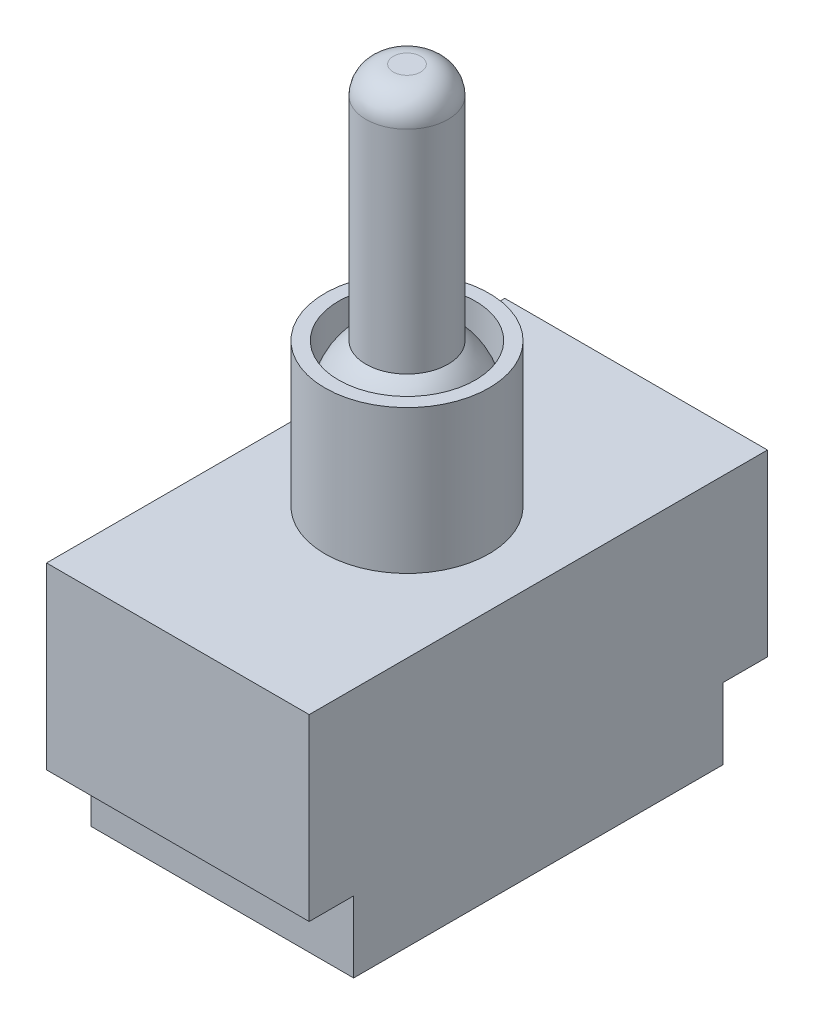
ISO-10303-21;
HEADER;
FILE_DESCRIPTION(('STEP AP214'),'2;1');
FILE_NAME('part.step','',(''),(''),'','','');
FILE_SCHEMA(('AUTOMOTIVE_DESIGN { 1 0 10303 214 1 1 1 1 }'));
ENDSEC;
DATA;
#1=APPLICATION_CONTEXT('core data for automotive mechanical design processes');
#2=APPLICATION_PROTOCOL_DEFINITION('international standard','automotive_design',2000,#1);
#3=PRODUCT_CONTEXT('',#1,'mechanical');
#4=PRODUCT('Part','Part','',(#3));
#5=PRODUCT_RELATED_PRODUCT_CATEGORY('part','',(#4));
#6=PRODUCT_DEFINITION_FORMATION('','',#4);
#7=PRODUCT_DEFINITION_CONTEXT('part definition',#1,'design');
#8=PRODUCT_DEFINITION('design','',#6,#7);
#9=PRODUCT_DEFINITION_SHAPE('','',#8);
#10=(LENGTH_UNIT() NAMED_UNIT(*) SI_UNIT(.MILLI.,.METRE.));
#11=(NAMED_UNIT(*) PLANE_ANGLE_UNIT() SI_UNIT($,.RADIAN.));
#12=(NAMED_UNIT(*) SI_UNIT($,.STERADIAN.) SOLID_ANGLE_UNIT());
#13=UNCERTAINTY_MEASURE_WITH_UNIT(LENGTH_MEASURE(1.E-05),#10,'distance_accuracy_value','');
#14=(GEOMETRIC_REPRESENTATION_CONTEXT(3) GLOBAL_UNCERTAINTY_ASSIGNED_CONTEXT((#13)) GLOBAL_UNIT_ASSIGNED_CONTEXT((#10,
#11,#12)) REPRESENTATION_CONTEXT('',''));
#15=CARTESIAN_POINT('',(0.,0.,0.));
#16=DIRECTION('',(0.,0.,1.));
#17=DIRECTION('',(1.,0.,0.));
#18=AXIS2_PLACEMENT_3D('',#15,#16,#17);
#19=CARTESIAN_POINT('',(0.,0.,0.));
#20=DIRECTION('',(0.,1.,0.));
#21=DIRECTION('',(0.,0.,1.));
#22=AXIS2_PLACEMENT_3D('',#19,#20,#21);
#23=PLANE('',#22);
#24=DIRECTION('',(-1.,0.,0.));
#25=VECTOR('',#24,1.);
#26=CARTESIAN_POINT('',(9.6,0.,13.5));
#27=LINE('',#26,#25);
#28=CARTESIAN_POINT('',(9.6,0.,13.5));
#29=VERTEX_POINT('',#28);
#30=CARTESIAN_POINT('',(-9.6,0.,13.5));
#31=VERTEX_POINT('',#30);
#32=EDGE_CURVE('E50',#29,#31,#27,.T.);
#33=ORIENTED_EDGE('',*,*,#32,.F.);
#34=DIRECTION('',(0.,0.,-1.));
#35=VECTOR('',#34,1.);
#36=CARTESIAN_POINT('',(9.6,0.,16.75));
#37=LINE('',#36,#35);
#38=CARTESIAN_POINT('',(9.6,0.,16.75));
#39=VERTEX_POINT('',#38);
#40=EDGE_CURVE('E157',#39,#29,#37,.T.);
#41=ORIENTED_EDGE('',*,*,#40,.F.);
#42=DIRECTION('',(1.,0.,0.));
#43=VECTOR('',#42,1.);
#44=CARTESIAN_POINT('',(9.6,0.,16.75));
#45=LINE('',#44,#43);
#46=CARTESIAN_POINT('',(-9.6,0.,16.75));
#47=VERTEX_POINT('',#46);
#48=EDGE_CURVE('E154',#47,#39,#45,.T.);
#49=ORIENTED_EDGE('',*,*,#48,.F.);
#50=DIRECTION('',(0.,0.,1.));
#51=VECTOR('',#50,1.);
#52=CARTESIAN_POINT('',(-9.6,0.,16.75));
#53=LINE('',#52,#51);
#54=EDGE_CURVE('E55',#31,#47,#53,.T.);
#55=ORIENTED_EDGE('',*,*,#54,.F.);
#56=EDGE_LOOP('',(#33,#41,#49,#55));
#57=FACE_BOUND('',#56,.T.);
#58=ADVANCED_FACE('F35',(#57),#23,.F.);
#59=DIRECTION('',(1.,0.,0.));
#60=VECTOR('',#59,1.);
#61=CARTESIAN_POINT('',(9.6,0.,-13.5));
#62=LINE('',#61,#60);
#63=CARTESIAN_POINT('',(-9.6,0.,-13.5));
#64=VERTEX_POINT('',#63);
#65=CARTESIAN_POINT('',(9.6,0.,-13.5));
#66=VERTEX_POINT('',#65);
#67=EDGE_CURVE('E327',#64,#66,#62,.T.);
#68=ORIENTED_EDGE('',*,*,#67,.F.);
#69=CARTESIAN_POINT('',(-9.6,0.,-16.75));
#70=VERTEX_POINT('',#69);
#71=EDGE_CURVE('E124',#70,#64,#53,.T.);
#72=ORIENTED_EDGE('',*,*,#71,.F.);
#73=DIRECTION('',(-1.,0.,0.));
#74=VECTOR('',#73,1.);
#75=CARTESIAN_POINT('',(9.6,0.,-16.75));
#76=LINE('',#75,#74);
#77=CARTESIAN_POINT('',(9.6,0.,-16.75));
#78=VERTEX_POINT('',#77);
#79=EDGE_CURVE('E146',#78,#70,#76,.T.);
#80=ORIENTED_EDGE('',*,*,#79,.F.);
#81=EDGE_CURVE('E156',#66,#78,#37,.T.);
#82=ORIENTED_EDGE('',*,*,#81,.F.);
#83=EDGE_LOOP('',(#68,#72,#80,#82));
#84=FACE_BOUND('',#83,.T.);
#85=ADVANCED_FACE('F190',(#84),#23,.F.);
#86=CARTESIAN_POINT('',(-9.6,13.1,16.75));
#87=DIRECTION('',(1.,0.,0.));
#88=DIRECTION('',(0.,0.,-1.));
#89=AXIS2_PLACEMENT_3D('',#86,#87,#88);
#90=PLANE('',#89);
#91=ORIENTED_EDGE('',*,*,#71,.T.);
#92=DIRECTION('',(0.,1.,0.));
#93=VECTOR('',#92,1.);
#94=CARTESIAN_POINT('',(-9.6,-5.2,-13.5));
#95=LINE('',#94,#93);
#96=CARTESIAN_POINT('',(-9.6,-5.2,-13.5));
#97=VERTEX_POINT('',#96);
#98=EDGE_CURVE('E104',#97,#64,#95,.T.);
#99=ORIENTED_EDGE('',*,*,#98,.F.);
#100=DIRECTION('',(0.,0.,-1.));
#101=VECTOR('',#100,1.);
#102=CARTESIAN_POINT('',(-9.6,-5.2,13.5));
#103=LINE('',#102,#101);
#104=CARTESIAN_POINT('',(-9.6,-5.2,13.5));
#105=VERTEX_POINT('',#104);
#106=EDGE_CURVE('E110',#105,#97,#103,.T.);
#107=ORIENTED_EDGE('',*,*,#106,.F.);
#108=DIRECTION('',(0.,1.,0.));
#109=VECTOR('',#108,1.);
#110=CARTESIAN_POINT('',(-9.6,-5.2,13.5));
#111=LINE('',#110,#109);
#112=EDGE_CURVE('E325',#105,#31,#111,.T.);
#113=ORIENTED_EDGE('',*,*,#112,.T.);
#114=ORIENTED_EDGE('',*,*,#54,.T.);
#115=DIRECTION('',(0.,-1.,0.));
#116=VECTOR('',#115,1.);
#117=CARTESIAN_POINT('',(-9.6,13.1,16.75));
#118=LINE('',#117,#116);
#119=CARTESIAN_POINT('',(-9.6,13.1,16.75));
#120=VERTEX_POINT('',#119);
#121=EDGE_CURVE('E167',#120,#47,#118,.T.);
#122=ORIENTED_EDGE('',*,*,#121,.F.);
#123=DIRECTION('',(0.,0.,1.));
#124=VECTOR('',#123,1.);
#125=CARTESIAN_POINT('',(-9.6,13.1,16.75));
#126=LINE('',#125,#124);
#127=CARTESIAN_POINT('',(-9.6,13.1,-16.75));
#128=VERTEX_POINT('',#127);
#129=EDGE_CURVE('E142',#128,#120,#126,.T.);
#130=ORIENTED_EDGE('',*,*,#129,.F.);
#131=DIRECTION('',(0.,-1.,0.));
#132=VECTOR('',#131,1.);
#133=CARTESIAN_POINT('',(-9.6,13.1,-16.75));
#134=LINE('',#133,#132);
#135=EDGE_CURVE('E152',#128,#70,#134,.T.);
#136=ORIENTED_EDGE('',*,*,#135,.T.);
#137=EDGE_LOOP('',(#91,#99,#107,#113,#114,#122,#130,#136));
#138=FACE_BOUND('',#137,.T.);
#139=ADVANCED_FACE('F121',(#138),#90,.F.);
#140=CARTESIAN_POINT('',(9.6,13.1,16.75));
#141=DIRECTION('',(0.,0.,-1.));
#142=DIRECTION('',(-1.,0.,0.));
#143=AXIS2_PLACEMENT_3D('',#140,#141,#142);
#144=PLANE('',#143);
#145=ORIENTED_EDGE('',*,*,#48,.T.);
#146=DIRECTION('',(0.,-1.,0.));
#147=VECTOR('',#146,1.);
#148=CARTESIAN_POINT('',(9.6,13.1,16.75));
#149=LINE('',#148,#147);
#150=CARTESIAN_POINT('',(9.6,13.1,16.75));
#151=VERTEX_POINT('',#150);
#152=EDGE_CURVE('E164',#151,#39,#149,.T.);
#153=ORIENTED_EDGE('',*,*,#152,.F.);
#154=DIRECTION('',(1.,0.,0.));
#155=VECTOR('',#154,1.);
#156=CARTESIAN_POINT('',(9.6,13.1,16.75));
#157=LINE('',#156,#155);
#158=EDGE_CURVE('E145',#120,#151,#157,.T.);
#159=ORIENTED_EDGE('',*,*,#158,.F.);
#160=ORIENTED_EDGE('',*,*,#121,.T.);
#161=EDGE_LOOP('',(#145,#153,#159,#160));
#162=FACE_BOUND('',#161,.T.);
#163=ADVANCED_FACE('F207',(#162),#144,.F.);
#164=CARTESIAN_POINT('',(9.6,13.1,16.75));
#165=DIRECTION('',(-1.,0.,0.));
#166=DIRECTION('',(0.,0.,1.));
#167=AXIS2_PLACEMENT_3D('',#164,#165,#166);
#168=PLANE('',#167);
#169=ORIENTED_EDGE('',*,*,#40,.T.);
#170=DIRECTION('',(0.,1.,0.));
#171=VECTOR('',#170,1.);
#172=CARTESIAN_POINT('',(9.6,-5.2,13.5));
#173=LINE('',#172,#171);
#174=CARTESIAN_POINT('',(9.6,-5.2,13.5));
#175=VERTEX_POINT('',#174);
#176=EDGE_CURVE('E130',#175,#29,#173,.T.);
#177=ORIENTED_EDGE('',*,*,#176,.F.);
#178=DIRECTION('',(0.,0.,1.));
#179=VECTOR('',#178,1.);
#180=CARTESIAN_POINT('',(9.6,-5.2,13.5));
#181=LINE('',#180,#179);
#182=CARTESIAN_POINT('',(9.6,-5.2,-13.5));
#183=VERTEX_POINT('',#182);
#184=EDGE_CURVE('E109',#183,#175,#181,.T.);
#185=ORIENTED_EDGE('',*,*,#184,.F.);
#186=DIRECTION('',(0.,1.,0.));
#187=VECTOR('',#186,1.);
#188=CARTESIAN_POINT('',(9.6,-5.2,-13.5));
#189=LINE('',#188,#187);
#190=EDGE_CURVE('E106',#183,#66,#189,.T.);
#191=ORIENTED_EDGE('',*,*,#190,.T.);
#192=ORIENTED_EDGE('',*,*,#81,.T.);
#193=DIRECTION('',(0.,-1.,0.));
#194=VECTOR('',#193,1.);
#195=CARTESIAN_POINT('',(9.6,13.1,-16.75));
#196=LINE('',#195,#194);
#197=CARTESIAN_POINT('',(9.6,13.1,-16.75));
#198=VERTEX_POINT('',#197);
#199=EDGE_CURVE('E161',#198,#78,#196,.T.);
#200=ORIENTED_EDGE('',*,*,#199,.F.);
#201=DIRECTION('',(0.,0.,-1.));
#202=VECTOR('',#201,1.);
#203=CARTESIAN_POINT('',(9.6,13.1,16.75));
#204=LINE('',#203,#202);
#205=EDGE_CURVE('E148',#151,#198,#204,.T.);
#206=ORIENTED_EDGE('',*,*,#205,.F.);
#207=ORIENTED_EDGE('',*,*,#152,.T.);
#208=EDGE_LOOP('',(#169,#177,#185,#191,#192,#200,#206,#207));
#209=FACE_BOUND('',#208,.T.);
#210=ADVANCED_FACE('F203',(#209),#168,.F.);
#211=CARTESIAN_POINT('',(9.6,13.1,-16.75));
#212=DIRECTION('',(0.,0.,1.));
#213=DIRECTION('',(1.,0.,0.));
#214=AXIS2_PLACEMENT_3D('',#211,#212,#213);
#215=PLANE('',#214);
#216=ORIENTED_EDGE('',*,*,#79,.T.);
#217=ORIENTED_EDGE('',*,*,#135,.F.);
#218=DIRECTION('',(-1.,0.,0.));
#219=VECTOR('',#218,1.);
#220=CARTESIAN_POINT('',(9.6,13.1,-16.75));
#221=LINE('',#220,#219);
#222=EDGE_CURVE('E150',#198,#128,#221,.T.);
#223=ORIENTED_EDGE('',*,*,#222,.F.);
#224=ORIENTED_EDGE('',*,*,#199,.T.);
#225=EDGE_LOOP('',(#216,#217,#223,#224));
#226=FACE_BOUND('',#225,.T.);
#227=ADVANCED_FACE('F200',(#226),#215,.F.);
#228=CARTESIAN_POINT('',(0.,13.1,0.));
#229=DIRECTION('',(0.,1.,0.));
#230=DIRECTION('',(0.,0.,1.));
#231=AXIS2_PLACEMENT_3D('',#228,#229,#230);
#232=PLANE('',#231);
#233=CARTESIAN_POINT('',(0.,13.1,0.));
#234=DIRECTION('',(0.,1.,0.));
#235=DIRECTION('',(0.,0.,1.));
#236=AXIS2_PLACEMENT_3D('',#233,#234,#235);
#237=CIRCLE('',#236,6.);
#238=CARTESIAN_POINT('',(0.,13.1,6.));
#239=VERTEX_POINT('',#238);
#240=EDGE_CURVE('E135',#239,#239,#237,.T.);
#241=ORIENTED_EDGE('',*,*,#240,.F.);
#242=EDGE_LOOP('',(#241));
#243=FACE_BOUND('',#242,.T.);
#244=ORIENTED_EDGE('',*,*,#129,.T.);
#245=ORIENTED_EDGE('',*,*,#158,.T.);
#246=ORIENTED_EDGE('',*,*,#205,.T.);
#247=ORIENTED_EDGE('',*,*,#222,.T.);
#248=EDGE_LOOP('',(#244,#245,#246,#247));
#249=FACE_BOUND('',#248,.T.);
#250=ADVANCED_FACE('F198',(#243,#249),#232,.T.);
#251=CARTESIAN_POINT('',(0.,23.6,0.));
#252=DIRECTION('',(0.,-1.,0.));
#253=DIRECTION('',(0.,0.,-1.));
#254=AXIS2_PLACEMENT_3D('',#251,#252,#253);
#255=CYLINDRICAL_SURFACE('',#254,6.);
#256=CARTESIAN_POINT('',(0.,23.6,0.));
#257=DIRECTION('',(0.,1.,0.));
#258=DIRECTION('',(0.,0.,1.));
#259=AXIS2_PLACEMENT_3D('',#256,#257,#258);
#260=CIRCLE('',#259,6.);
#261=CARTESIAN_POINT('',(0.,23.6,6.));
#262=VERTEX_POINT('',#261);
#263=EDGE_CURVE('E137',#262,#262,#260,.T.);
#264=ORIENTED_EDGE('',*,*,#263,.F.);
#265=EDGE_LOOP('',(#264));
#266=FACE_BOUND('',#265,.T.);
#267=ORIENTED_EDGE('',*,*,#240,.T.);
#268=EDGE_LOOP('',(#267));
#269=FACE_BOUND('',#268,.T.);
#270=ADVANCED_FACE('F235',(#266,#269),#255,.T.);
#271=CARTESIAN_POINT('',(0.,23.6,0.));
#272=DIRECTION('',(0.,1.,0.));
#273=DIRECTION('',(0.,0.,1.));
#274=AXIS2_PLACEMENT_3D('',#271,#272,#273);
#275=PLANE('',#274);
#276=CARTESIAN_POINT('',(0.,23.6,0.));
#277=DIRECTION('',(0.,1.,0.));
#278=DIRECTION('',(0.,0.,1.));
#279=AXIS2_PLACEMENT_3D('',#276,#277,#278);
#280=CIRCLE('',#279,5.);
#281=CARTESIAN_POINT('',(0.,23.6,5.));
#282=VERTEX_POINT('',#281);
#283=EDGE_CURVE('E125',#282,#282,#280,.T.);
#284=ORIENTED_EDGE('',*,*,#283,.F.);
#285=EDGE_LOOP('',(#284));
#286=FACE_BOUND('',#285,.T.);
#287=ORIENTED_EDGE('',*,*,#263,.T.);
#288=EDGE_LOOP('',(#287));
#289=FACE_BOUND('',#288,.T.);
#290=ADVANCED_FACE('F242',(#286,#289),#275,.T.);
#291=CARTESIAN_POINT('',(0.,19.6,0.));
#292=DIRECTION('',(0.,1.,0.));
#293=DIRECTION('',(0.,0.,1.));
#294=AXIS2_PLACEMENT_3D('',#291,#292,#293);
#295=CYLINDRICAL_SURFACE('',#294,5.);
#296=CARTESIAN_POINT('',(0.,19.6,0.));
#297=DIRECTION('',(0.,1.,0.));
#298=DIRECTION('',(0.,0.,1.));
#299=AXIS2_PLACEMENT_3D('',#296,#297,#298);
#300=CIRCLE('',#299,5.);
#301=CARTESIAN_POINT('',(0.,19.6,5.));
#302=VERTEX_POINT('',#301);
#303=EDGE_CURVE('E128',#302,#302,#300,.T.);
#304=ORIENTED_EDGE('',*,*,#303,.F.);
#305=EDGE_LOOP('',(#304));
#306=FACE_BOUND('',#305,.T.);
#307=ORIENTED_EDGE('',*,*,#283,.T.);
#308=EDGE_LOOP('',(#307));
#309=FACE_BOUND('',#308,.T.);
#310=ADVANCED_FACE('F249',(#306,#309),#295,.F.);
#311=CARTESIAN_POINT('',(0.,19.6,0.));
#312=DIRECTION('',(0.,0.,1.));
#313=DIRECTION('',(1.,0.,0.));
#314=AXIS2_PLACEMENT_3D('',#311,#312,#313);
#315=SPHERICAL_SURFACE('',#314,5.);
#316=CARTESIAN_POINT('',(0.,19.6,0.));
#317=DIRECTION('',(0.,1.,0.));
#318=DIRECTION('',(0.,0.,1.));
#319=AXIS2_PLACEMENT_3D('',#316,#317,#318);
#320=SPHERICAL_SURFACE('',#319,5.);
#321=ORIENTED_EDGE('',*,*,#303,.T.);
#322=EDGE_LOOP('',(#321));
#323=FACE_BOUND('',#322,.T.);
#324=CARTESIAN_POINT('',(0.,23.6,0.));
#325=DIRECTION('',(0.,-1.,0.));
#326=DIRECTION('',(0.,0.,-1.));
#327=AXIS2_PLACEMENT_3D('',#324,#325,#326);
#328=CIRCLE('',#327,3.);
#329=CARTESIAN_POINT('',(0.,23.6,-3.));
#330=VERTEX_POINT('',#329);
#331=EDGE_CURVE('E170',#330,#330,#328,.T.);
#332=ORIENTED_EDGE('',*,*,#331,.T.);
#333=EDGE_LOOP('',(#332));
#334=FACE_BOUND('',#333,.T.);
#335=ADVANCED_FACE('F257',(#323,#334),#320,.T.);
#336=CARTESIAN_POINT('',(0.,41.1,0.));
#337=DIRECTION('',(0.,1.,0.));
#338=DIRECTION('',(0.,0.,1.));
#339=AXIS2_PLACEMENT_3D('',#336,#337,#338);
#340=PLANE('',#339);
#341=CARTESIAN_POINT('',(0.,41.1,0.));
#342=DIRECTION('',(0.,1.,0.));
#343=DIRECTION('',(0.,0.,1.));
#344=AXIS2_PLACEMENT_3D('',#341,#342,#343);
#345=CIRCLE('',#344,1.);
#346=CARTESIAN_POINT('',(0.,41.1,1.));
#347=VERTEX_POINT('',#346);
#348=EDGE_CURVE('E43',#347,#347,#345,.T.);
#349=ORIENTED_EDGE('',*,*,#348,.T.);
#350=EDGE_LOOP('',(#349));
#351=FACE_BOUND('',#350,.T.);
#352=ADVANCED_FACE('F175',(#351),#340,.T.);
#353=CARTESIAN_POINT('',(0.,41.1,0.));
#354=DIRECTION('',(0.,-1.,0.));
#355=DIRECTION('',(0.,0.,-1.));
#356=AXIS2_PLACEMENT_3D('',#353,#354,#355);
#357=CYLINDRICAL_SURFACE('',#356,3.);
#358=CARTESIAN_POINT('',(0.,39.1,0.));
#359=DIRECTION('',(0.,1.,0.));
#360=DIRECTION('',(0.,0.,1.));
#361=AXIS2_PLACEMENT_3D('',#358,#359,#360);
#362=CIRCLE('',#361,3.);
#363=CARTESIAN_POINT('',(0.,39.1,3.));
#364=VERTEX_POINT('',#363);
#365=EDGE_CURVE('E11',#364,#364,#362,.F.);
#366=ORIENTED_EDGE('',*,*,#365,.T.);
#367=EDGE_LOOP('',(#366));
#368=FACE_BOUND('',#367,.T.);
#369=ORIENTED_EDGE('',*,*,#331,.F.);
#370=EDGE_LOOP('',(#369));
#371=FACE_BOUND('',#370,.T.);
#372=ADVANCED_FACE('F178',(#368,#371),#357,.T.);
#373=CARTESIAN_POINT('',(0.,39.1,0.));
#374=DIRECTION('',(0.,1.,0.));
#375=DIRECTION('',(0.,0.,1.));
#376=AXIS2_PLACEMENT_3D('',#373,#374,#375);
#377=DEGENERATE_TOROIDAL_SURFACE('',#376,1.,2.,.T.);
#378=ORIENTED_EDGE('',*,*,#365,.F.);
#379=EDGE_LOOP('',(#378));
#380=FACE_BOUND('',#379,.T.);
#381=ORIENTED_EDGE('',*,*,#348,.F.);
#382=EDGE_LOOP('',(#381));
#383=FACE_BOUND('',#382,.T.);
#384=ADVANCED_FACE('F37',(#380,#383),#377,.T.);
#385=CARTESIAN_POINT('',(9.6,-5.2,-13.5));
#386=DIRECTION('',(0.,0.,1.));
#387=DIRECTION('',(1.,0.,0.));
#388=AXIS2_PLACEMENT_3D('',#385,#386,#387);
#389=PLANE('',#388);
#390=ORIENTED_EDGE('',*,*,#67,.T.);
#391=ORIENTED_EDGE('',*,*,#190,.F.);
#392=DIRECTION('',(1.,0.,0.));
#393=VECTOR('',#392,1.);
#394=CARTESIAN_POINT('',(9.6,-5.2,-13.5));
#395=LINE('',#394,#393);
#396=EDGE_CURVE('E99',#97,#183,#395,.T.);
#397=ORIENTED_EDGE('',*,*,#396,.F.);
#398=ORIENTED_EDGE('',*,*,#98,.T.);
#399=EDGE_LOOP('',(#390,#391,#397,#398));
#400=FACE_BOUND('',#399,.T.);
#401=ADVANCED_FACE('F102',(#400),#389,.F.);
#402=CARTESIAN_POINT('',(9.6,-5.2,13.5));
#403=DIRECTION('',(0.,0.,-1.));
#404=DIRECTION('',(-1.,0.,0.));
#405=AXIS2_PLACEMENT_3D('',#402,#403,#404);
#406=PLANE('',#405);
#407=ORIENTED_EDGE('',*,*,#32,.T.);
#408=ORIENTED_EDGE('',*,*,#112,.F.);
#409=DIRECTION('',(-1.,0.,0.));
#410=VECTOR('',#409,1.);
#411=CARTESIAN_POINT('',(9.6,-5.2,13.5));
#412=LINE('',#411,#410);
#413=EDGE_CURVE('E115',#175,#105,#412,.T.);
#414=ORIENTED_EDGE('',*,*,#413,.F.);
#415=ORIENTED_EDGE('',*,*,#176,.T.);
#416=EDGE_LOOP('',(#407,#408,#414,#415));
#417=FACE_BOUND('',#416,.T.);
#418=ADVANCED_FACE('F184',(#417),#406,.F.);
#419=CARTESIAN_POINT('',(0.,-5.2,0.));
#420=DIRECTION('',(0.,1.,0.));
#421=DIRECTION('',(0.,0.,1.));
#422=AXIS2_PLACEMENT_3D('',#419,#420,#421);
#423=PLANE('',#422);
#424=ORIENTED_EDGE('',*,*,#106,.T.);
#425=ORIENTED_EDGE('',*,*,#396,.T.);
#426=ORIENTED_EDGE('',*,*,#184,.T.);
#427=ORIENTED_EDGE('',*,*,#413,.T.);
#428=EDGE_LOOP('',(#424,#425,#426,#427));
#429=FACE_BOUND('',#428,.T.);
#430=ADVANCED_FACE('F113',(#429),#423,.F.);
#431=CLOSED_SHELL('',(#58,#85,#139,#163,#210,#227,#250,#270,#290,#310,#335,#352,#372,#384,#401,
#418,#430));
#432=MANIFOLD_SOLID_BREP('B2',#431);
#433=ADVANCED_BREP_SHAPE_REPRESENTATION('',(#18,#432),#14);
#434=SHAPE_DEFINITION_REPRESENTATION(#9,#433);
ENDSEC;
END-ISO-10303-21;
